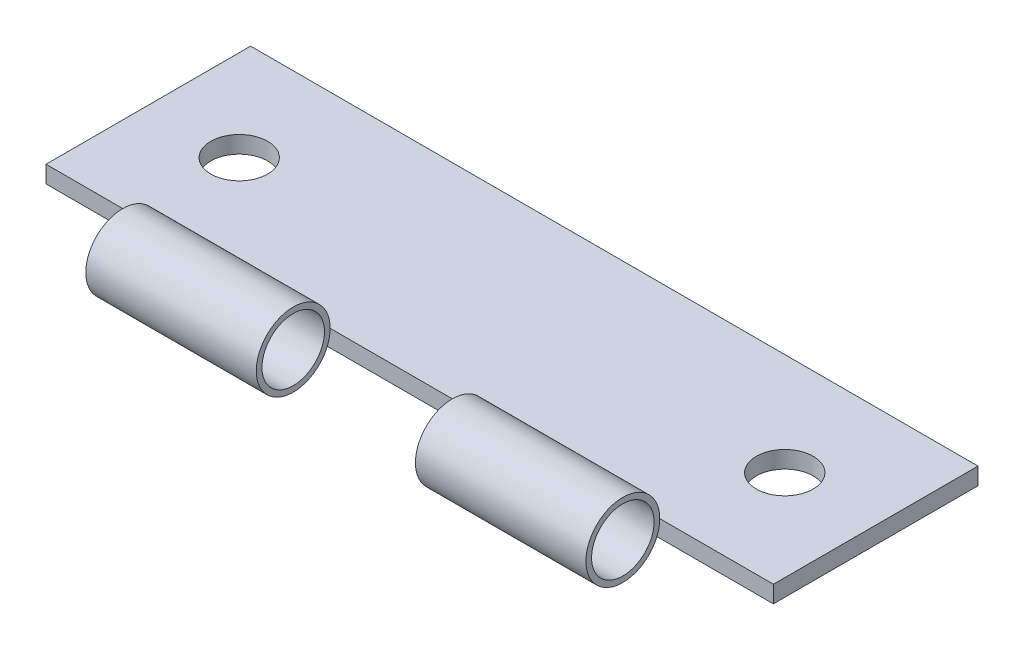
ISO-10303-21;
HEADER;
FILE_DESCRIPTION(('STEP AP214'),'2;1');
FILE_NAME('part.step','',(''),(''),'','','');
FILE_SCHEMA(('AUTOMOTIVE_DESIGN { 1 0 10303 214 1 1 1 1 }'));
ENDSEC;
DATA;
#1=APPLICATION_CONTEXT('core data for automotive mechanical design processes');
#2=APPLICATION_PROTOCOL_DEFINITION('international standard','automotive_design',2000,#1);
#3=PRODUCT_CONTEXT('',#1,'mechanical');
#4=PRODUCT('Part','Part','',(#3));
#5=PRODUCT_RELATED_PRODUCT_CATEGORY('part','',(#4));
#6=PRODUCT_DEFINITION_FORMATION('','',#4);
#7=PRODUCT_DEFINITION_CONTEXT('part definition',#1,'design');
#8=PRODUCT_DEFINITION('design','',#6,#7);
#9=PRODUCT_DEFINITION_SHAPE('','',#8);
#10=(LENGTH_UNIT() NAMED_UNIT(*) SI_UNIT(.MILLI.,.METRE.));
#11=(NAMED_UNIT(*) PLANE_ANGLE_UNIT() SI_UNIT($,.RADIAN.));
#12=(NAMED_UNIT(*) SI_UNIT($,.STERADIAN.) SOLID_ANGLE_UNIT());
#13=UNCERTAINTY_MEASURE_WITH_UNIT(LENGTH_MEASURE(1.E-05),#10,'distance_accuracy_value','');
#14=(GEOMETRIC_REPRESENTATION_CONTEXT(3) GLOBAL_UNCERTAINTY_ASSIGNED_CONTEXT((#13)) GLOBAL_UNIT_ASSIGNED_CONTEXT((#10,
#11,#12)) REPRESENTATION_CONTEXT('',''));
#15=CARTESIAN_POINT('',(0.,0.,0.));
#16=DIRECTION('',(0.,0.,1.));
#17=DIRECTION('',(1.,0.,0.));
#18=AXIS2_PLACEMENT_3D('',#15,#16,#17);
#19=CARTESIAN_POINT('',(32.,1.5,12.25));
#20=DIRECTION('',(-1.,0.,0.));
#21=DIRECTION('',(0.,0.,1.));
#22=AXIS2_PLACEMENT_3D('',#19,#20,#21);
#23=CYLINDRICAL_SURFACE('',#22,3.25);
#24=CARTESIAN_POINT('',(-22.,1.5,12.25));
#25=DIRECTION('',(1.,0.,0.));
#26=DIRECTION('',(0.,0.,-1.));
#27=AXIS2_PLACEMENT_3D('',#24,#25,#26);
#28=CIRCLE('',#27,3.25);
#29=CARTESIAN_POINT('',(-22.,1.5,9.));
#30=VERTEX_POINT('',#29);
#31=EDGE_CURVE('E45',#30,#30,#28,.T.);
#32=ORIENTED_EDGE('',*,*,#31,.T.);
#33=EDGE_LOOP('',(#32));
#34=FACE_BOUND('',#33,.T.);
#35=CARTESIAN_POINT('',(-7.,1.5,12.25));
#36=DIRECTION('',(1.,0.,0.));
#37=DIRECTION('',(0.,0.,-1.));
#38=AXIS2_PLACEMENT_3D('',#35,#36,#37);
#39=CIRCLE('',#38,3.25);
#40=CARTESIAN_POINT('',(-7.,1.5,9.));
#41=VERTEX_POINT('',#40);
#42=EDGE_CURVE('E11',#41,#41,#39,.T.);
#43=ORIENTED_EDGE('',*,*,#42,.F.);
#44=EDGE_LOOP('',(#43));
#45=FACE_BOUND('',#44,.T.);
#46=ADVANCED_FACE('F39',(#34,#45),#23,.T.);
#47=CARTESIAN_POINT('',(-7.,10.,9.));
#48=DIRECTION('',(1.,0.,0.));
#49=DIRECTION('',(0.,0.,-1.));
#50=AXIS2_PLACEMENT_3D('',#47,#48,#49);
#51=PLANE('',#50);
#52=CARTESIAN_POINT('',(-7.,1.5,12.25));
#53=DIRECTION('',(1.,0.,0.));
#54=DIRECTION('',(0.,0.,-1.));
#55=AXIS2_PLACEMENT_3D('',#52,#53,#54);
#56=CIRCLE('',#55,2.75);
#57=CARTESIAN_POINT('',(-7.,1.5,9.50000000000001));
#58=VERTEX_POINT('',#57);
#59=EDGE_CURVE('E49',#58,#58,#56,.T.);
#60=ORIENTED_EDGE('',*,*,#59,.F.);
#61=EDGE_LOOP('',(#60));
#62=FACE_BOUND('',#61,.T.);
#63=ORIENTED_EDGE('',*,*,#42,.T.);
#64=EDGE_LOOP('',(#63));
#65=FACE_BOUND('',#64,.T.);
#66=ADVANCED_FACE('F69',(#62,#65),#51,.T.);
#67=CARTESIAN_POINT('',(-22.,10.,9.));
#68=DIRECTION('',(1.,0.,0.));
#69=DIRECTION('',(0.,0.,-1.));
#70=AXIS2_PLACEMENT_3D('',#67,#68,#69);
#71=PLANE('',#70);
#72=CARTESIAN_POINT('',(-22.,1.5,12.25));
#73=DIRECTION('',(1.,0.,0.));
#74=DIRECTION('',(0.,0.,-1.));
#75=AXIS2_PLACEMENT_3D('',#72,#73,#74);
#76=CIRCLE('',#75,2.75);
#77=CARTESIAN_POINT('',(-22.,1.5,9.50000000000002));
#78=VERTEX_POINT('',#77);
#79=EDGE_CURVE('E53',#78,#78,#76,.T.);
#80=ORIENTED_EDGE('',*,*,#79,.T.);
#81=EDGE_LOOP('',(#80));
#82=FACE_BOUND('',#81,.T.);
#83=ORIENTED_EDGE('',*,*,#31,.F.);
#84=EDGE_LOOP('',(#83));
#85=FACE_BOUND('',#84,.T.);
#86=ADVANCED_FACE('F59',(#82,#85),#71,.F.);
#87=CARTESIAN_POINT('',(-22.,1.5,12.25));
#88=DIRECTION('',(1.,0.,0.));
#89=DIRECTION('',(0.,0.,-1.));
#90=AXIS2_PLACEMENT_3D('',#87,#88,#89);
#91=CYLINDRICAL_SURFACE('',#90,2.75);
#92=ORIENTED_EDGE('',*,*,#59,.T.);
#93=EDGE_LOOP('',(#92));
#94=FACE_BOUND('',#93,.T.);
#95=ORIENTED_EDGE('',*,*,#79,.F.);
#96=EDGE_LOOP('',(#95));
#97=FACE_BOUND('',#96,.T.);
#98=ADVANCED_FACE('F62',(#94,#97),#91,.F.);
#99=CLOSED_SHELL('',(#46,#66,#86,#98));
#100=MANIFOLD_SOLID_BREP('B2',#99);
#101=CARTESIAN_POINT('',(32.,1.5,12.25));
#102=DIRECTION('',(-1.,0.,0.));
#103=DIRECTION('',(0.,0.,1.));
#104=AXIS2_PLACEMENT_3D('',#101,#102,#103);
#105=CYLINDRICAL_SURFACE('',#104,3.25);
#106=CARTESIAN_POINT('',(7.,1.5,12.25));
#107=DIRECTION('',(1.,0.,0.));
#108=DIRECTION('',(0.,0.,-1.));
#109=AXIS2_PLACEMENT_3D('',#106,#107,#108);
#110=CIRCLE('',#109,3.25);
#111=CARTESIAN_POINT('',(7.,1.5,9.));
#112=VERTEX_POINT('',#111);
#113=EDGE_CURVE('E38',#112,#112,#110,.T.);
#114=ORIENTED_EDGE('',*,*,#113,.T.);
#115=EDGE_LOOP('',(#114));
#116=FACE_BOUND('',#115,.T.);
#117=CARTESIAN_POINT('',(22.,1.5,12.25));
#118=DIRECTION('',(1.,0.,0.));
#119=DIRECTION('',(0.,0.,-1.));
#120=AXIS2_PLACEMENT_3D('',#117,#118,#119);
#121=CIRCLE('',#120,3.25);
#122=CARTESIAN_POINT('',(22.,1.5,9.));
#123=VERTEX_POINT('',#122);
#124=EDGE_CURVE('E116',#123,#123,#121,.T.);
#125=ORIENTED_EDGE('',*,*,#124,.F.);
#126=EDGE_LOOP('',(#125));
#127=FACE_BOUND('',#126,.T.);
#128=ADVANCED_FACE('F109',(#116,#127),#105,.T.);
#129=CARTESIAN_POINT('',(22.,10.,9.));
#130=DIRECTION('',(1.,0.,0.));
#131=DIRECTION('',(0.,0.,-1.));
#132=AXIS2_PLACEMENT_3D('',#129,#130,#131);
#133=PLANE('',#132);
#134=CARTESIAN_POINT('',(22.,1.5,12.25));
#135=DIRECTION('',(1.,0.,0.));
#136=DIRECTION('',(0.,0.,-1.));
#137=AXIS2_PLACEMENT_3D('',#134,#135,#136);
#138=CIRCLE('',#137,2.75);
#139=CARTESIAN_POINT('',(22.,1.5,9.5));
#140=VERTEX_POINT('',#139);
#141=EDGE_CURVE('E122',#140,#140,#138,.T.);
#142=ORIENTED_EDGE('',*,*,#141,.F.);
#143=EDGE_LOOP('',(#142));
#144=FACE_BOUND('',#143,.T.);
#145=ORIENTED_EDGE('',*,*,#124,.T.);
#146=EDGE_LOOP('',(#145));
#147=FACE_BOUND('',#146,.T.);
#148=ADVANCED_FACE('F138',(#144,#147),#133,.T.);
#149=CARTESIAN_POINT('',(7.,10.,9.));
#150=DIRECTION('',(1.,0.,0.));
#151=DIRECTION('',(0.,0.,-1.));
#152=AXIS2_PLACEMENT_3D('',#149,#150,#151);
#153=PLANE('',#152);
#154=CARTESIAN_POINT('',(7.,1.5,12.25));
#155=DIRECTION('',(1.,0.,0.));
#156=DIRECTION('',(0.,0.,-1.));
#157=AXIS2_PLACEMENT_3D('',#154,#155,#156);
#158=CIRCLE('',#157,2.75);
#159=CARTESIAN_POINT('',(7.,1.5,9.50000000000001));
#160=VERTEX_POINT('',#159);
#161=EDGE_CURVE('E112',#160,#160,#158,.T.);
#162=ORIENTED_EDGE('',*,*,#161,.T.);
#163=EDGE_LOOP('',(#162));
#164=FACE_BOUND('',#163,.T.);
#165=ORIENTED_EDGE('',*,*,#113,.F.);
#166=EDGE_LOOP('',(#165));
#167=FACE_BOUND('',#166,.T.);
#168=ADVANCED_FACE('F129',(#164,#167),#153,.F.);
#169=CARTESIAN_POINT('',(-22.,1.5,12.25));
#170=DIRECTION('',(1.,0.,0.));
#171=DIRECTION('',(0.,0.,-1.));
#172=AXIS2_PLACEMENT_3D('',#169,#170,#171);
#173=CYLINDRICAL_SURFACE('',#172,2.75);
#174=ORIENTED_EDGE('',*,*,#141,.T.);
#175=EDGE_LOOP('',(#174));
#176=FACE_BOUND('',#175,.T.);
#177=ORIENTED_EDGE('',*,*,#161,.F.);
#178=EDGE_LOOP('',(#177));
#179=FACE_BOUND('',#178,.T.);
#180=ADVANCED_FACE('F132',(#176,#179),#173,.F.);
#181=CLOSED_SHELL('',(#128,#148,#168,#180));
#182=MANIFOLD_SOLID_BREP('B6',#181);
#183=CARTESIAN_POINT('',(32.,1.5,-9.));
#184=DIRECTION('',(-1.,0.,0.));
#185=DIRECTION('',(0.,0.,1.));
#186=AXIS2_PLACEMENT_3D('',#183,#184,#185);
#187=PLANE('',#186);
#188=DIRECTION('',(0.,0.,-1.));
#189=VECTOR('',#188,1.);
#190=CARTESIAN_POINT('',(32.,0.,-9.));
#191=LINE('',#190,#189);
#192=CARTESIAN_POINT('',(32.,0.,9.));
#193=VERTEX_POINT('',#192);
#194=CARTESIAN_POINT('',(32.,0.,-9.));
#195=VERTEX_POINT('',#194);
#196=EDGE_CURVE('E236',#193,#195,#191,.T.);
#197=ORIENTED_EDGE('',*,*,#196,.T.);
#198=DIRECTION('',(0.,-1.,0.));
#199=VECTOR('',#198,1.);
#200=CARTESIAN_POINT('',(32.,1.5,-9.));
#201=LINE('',#200,#199);
#202=CARTESIAN_POINT('',(32.,1.5,-9.));
#203=VERTEX_POINT('',#202);
#204=EDGE_CURVE('E107',#203,#195,#201,.T.);
#205=ORIENTED_EDGE('',*,*,#204,.F.);
#206=DIRECTION('',(0.,0.,-1.));
#207=VECTOR('',#206,1.);
#208=CARTESIAN_POINT('',(32.,1.5,-9.));
#209=LINE('',#208,#207);
#210=CARTESIAN_POINT('',(32.,1.5,9.));
#211=VERTEX_POINT('',#210);
#212=EDGE_CURVE('E223',#211,#203,#209,.T.);
#213=ORIENTED_EDGE('',*,*,#212,.F.);
#214=DIRECTION('',(0.,-1.,0.));
#215=VECTOR('',#214,1.);
#216=CARTESIAN_POINT('',(32.,1.5,9.));
#217=LINE('',#216,#215);
#218=EDGE_CURVE('E232',#211,#193,#217,.T.);
#219=ORIENTED_EDGE('',*,*,#218,.T.);
#220=EDGE_LOOP('',(#197,#205,#213,#219));
#221=FACE_BOUND('',#220,.T.);
#222=ADVANCED_FACE('F170',(#221),#187,.F.);
#223=CARTESIAN_POINT('',(-32.,1.5,-9.));
#224=DIRECTION('',(0.,0.,1.));
#225=DIRECTION('',(1.,0.,0.));
#226=AXIS2_PLACEMENT_3D('',#223,#224,#225);
#227=PLANE('',#226);
#228=DIRECTION('',(-1.,0.,0.));
#229=VECTOR('',#228,1.);
#230=CARTESIAN_POINT('',(-32.,0.,-9.));
#231=LINE('',#230,#229);
#232=CARTESIAN_POINT('',(-32.,0.,-9.));
#233=VERTEX_POINT('',#232);
#234=EDGE_CURVE('E227',#195,#233,#231,.T.);
#235=ORIENTED_EDGE('',*,*,#234,.T.);
#236=DIRECTION('',(0.,-1.,0.));
#237=VECTOR('',#236,1.);
#238=CARTESIAN_POINT('',(-32.,1.5,-9.));
#239=LINE('',#238,#237);
#240=CARTESIAN_POINT('',(-32.,1.5,-9.));
#241=VERTEX_POINT('',#240);
#242=EDGE_CURVE('E179',#241,#233,#239,.T.);
#243=ORIENTED_EDGE('',*,*,#242,.F.);
#244=DIRECTION('',(-1.,0.,0.));
#245=VECTOR('',#244,1.);
#246=CARTESIAN_POINT('',(-32.,1.5,-9.));
#247=LINE('',#246,#245);
#248=EDGE_CURVE('E218',#203,#241,#247,.T.);
#249=ORIENTED_EDGE('',*,*,#248,.F.);
#250=ORIENTED_EDGE('',*,*,#204,.T.);
#251=EDGE_LOOP('',(#235,#243,#249,#250));
#252=FACE_BOUND('',#251,.T.);
#253=ADVANCED_FACE('F226',(#252),#227,.F.);
#254=CARTESIAN_POINT('',(-32.,1.5,-9.));
#255=DIRECTION('',(1.,0.,0.));
#256=DIRECTION('',(0.,0.,-1.));
#257=AXIS2_PLACEMENT_3D('',#254,#255,#256);
#258=PLANE('',#257);
#259=DIRECTION('',(0.,0.,1.));
#260=VECTOR('',#259,1.);
#261=CARTESIAN_POINT('',(-32.,0.,-9.));
#262=LINE('',#261,#260);
#263=CARTESIAN_POINT('',(-32.,0.,9.));
#264=VERTEX_POINT('',#263);
#265=EDGE_CURVE('E205',#233,#264,#262,.T.);
#266=ORIENTED_EDGE('',*,*,#265,.T.);
#267=DIRECTION('',(0.,-1.,0.));
#268=VECTOR('',#267,1.);
#269=CARTESIAN_POINT('',(-32.,1.5,9.));
#270=LINE('',#269,#268);
#271=CARTESIAN_POINT('',(-32.,1.5,9.));
#272=VERTEX_POINT('',#271);
#273=EDGE_CURVE('E228',#272,#264,#270,.T.);
#274=ORIENTED_EDGE('',*,*,#273,.F.);
#275=DIRECTION('',(0.,0.,1.));
#276=VECTOR('',#275,1.);
#277=CARTESIAN_POINT('',(-32.,1.5,-9.));
#278=LINE('',#277,#276);
#279=EDGE_CURVE('E221',#241,#272,#278,.T.);
#280=ORIENTED_EDGE('',*,*,#279,.F.);
#281=ORIENTED_EDGE('',*,*,#242,.T.);
#282=EDGE_LOOP('',(#266,#274,#280,#281));
#283=FACE_BOUND('',#282,.T.);
#284=ADVANCED_FACE('F230',(#283),#258,.F.);
#285=CARTESIAN_POINT('',(-32.,1.5,9.));
#286=DIRECTION('',(0.,0.,-1.));
#287=DIRECTION('',(-1.,0.,0.));
#288=AXIS2_PLACEMENT_3D('',#285,#286,#287);
#289=PLANE('',#288);
#290=ORIENTED_EDGE('',*,*,#218,.F.);
#291=DIRECTION('',(1.,0.,0.));
#292=VECTOR('',#291,1.);
#293=CARTESIAN_POINT('',(-32.,1.5,9.));
#294=LINE('',#293,#292);
#295=EDGE_CURVE('E188',#272,#211,#294,.T.);
#296=ORIENTED_EDGE('',*,*,#295,.F.);
#297=ORIENTED_EDGE('',*,*,#273,.T.);
#298=DIRECTION('',(1.,0.,0.));
#299=VECTOR('',#298,1.);
#300=CARTESIAN_POINT('',(-32.,0.,9.));
#301=LINE('',#300,#299);
#302=EDGE_CURVE('E211',#264,#193,#301,.T.);
#303=ORIENTED_EDGE('',*,*,#302,.T.);
#304=EDGE_LOOP('',(#290,#296,#297,#303));
#305=FACE_BOUND('',#304,.T.);
#306=ADVANCED_FACE('F263',(#305),#289,.F.);
#307=CARTESIAN_POINT('',(0.,1.5,0.));
#308=DIRECTION('',(0.,1.,0.));
#309=DIRECTION('',(0.,0.,1.));
#310=AXIS2_PLACEMENT_3D('',#307,#308,#309);
#311=PLANE('',#310);
#312=CARTESIAN_POINT('',(-24.,1.5,0.));
#313=DIRECTION('',(0.,1.,0.));
#314=DIRECTION('',(0.,0.,1.));
#315=AXIS2_PLACEMENT_3D('',#312,#313,#314);
#316=CIRCLE('',#315,2.5);
#317=CARTESIAN_POINT('',(-24.,1.5,2.5));
#318=VERTEX_POINT('',#317);
#319=EDGE_CURVE('E245',#318,#318,#316,.T.);
#320=ORIENTED_EDGE('',*,*,#319,.F.);
#321=EDGE_LOOP('',(#320));
#322=FACE_BOUND('',#321,.T.);
#323=CARTESIAN_POINT('',(24.,1.5,0.));
#324=DIRECTION('',(0.,1.,0.));
#325=DIRECTION('',(0.,0.,1.));
#326=AXIS2_PLACEMENT_3D('',#323,#324,#325);
#327=CIRCLE('',#326,2.5);
#328=CARTESIAN_POINT('',(24.,1.5,2.5));
#329=VERTEX_POINT('',#328);
#330=EDGE_CURVE('E250',#329,#329,#327,.T.);
#331=ORIENTED_EDGE('',*,*,#330,.F.);
#332=EDGE_LOOP('',(#331));
#333=FACE_BOUND('',#332,.T.);
#334=ORIENTED_EDGE('',*,*,#212,.T.);
#335=ORIENTED_EDGE('',*,*,#248,.T.);
#336=ORIENTED_EDGE('',*,*,#279,.T.);
#337=ORIENTED_EDGE('',*,*,#295,.T.);
#338=EDGE_LOOP('',(#334,#335,#336,#337));
#339=FACE_BOUND('',#338,.T.);
#340=ADVANCED_FACE('F219',(#322,#333,#339),#311,.T.);
#341=CARTESIAN_POINT('',(0.,0.,0.));
#342=DIRECTION('',(0.,1.,0.));
#343=DIRECTION('',(0.,0.,1.));
#344=AXIS2_PLACEMENT_3D('',#341,#342,#343);
#345=PLANE('',#344);
#346=CARTESIAN_POINT('',(-24.,0.,0.));
#347=DIRECTION('',(0.,1.,0.));
#348=DIRECTION('',(0.,0.,1.));
#349=AXIS2_PLACEMENT_3D('',#346,#347,#348);
#350=CIRCLE('',#349,2.5);
#351=CARTESIAN_POINT('',(-24.,0.,2.5));
#352=VERTEX_POINT('',#351);
#353=EDGE_CURVE('E173',#352,#352,#350,.T.);
#354=ORIENTED_EDGE('',*,*,#353,.T.);
#355=EDGE_LOOP('',(#354));
#356=FACE_BOUND('',#355,.T.);
#357=CARTESIAN_POINT('',(24.,0.,0.));
#358=DIRECTION('',(0.,1.,0.));
#359=DIRECTION('',(0.,0.,1.));
#360=AXIS2_PLACEMENT_3D('',#357,#358,#359);
#361=CIRCLE('',#360,2.5);
#362=CARTESIAN_POINT('',(24.,0.,2.5));
#363=VERTEX_POINT('',#362);
#364=EDGE_CURVE('E243',#363,#363,#361,.T.);
#365=ORIENTED_EDGE('',*,*,#364,.T.);
#366=EDGE_LOOP('',(#365));
#367=FACE_BOUND('',#366,.T.);
#368=ORIENTED_EDGE('',*,*,#196,.F.);
#369=ORIENTED_EDGE('',*,*,#302,.F.);
#370=ORIENTED_EDGE('',*,*,#265,.F.);
#371=ORIENTED_EDGE('',*,*,#234,.F.);
#372=EDGE_LOOP('',(#368,#369,#370,#371));
#373=FACE_BOUND('',#372,.T.);
#374=ADVANCED_FACE('F262',(#356,#367,#373),#345,.F.);
#375=CARTESIAN_POINT('',(24.,-8.5,0.));
#376=DIRECTION('',(0.,1.,0.));
#377=DIRECTION('',(0.,0.,1.));
#378=AXIS2_PLACEMENT_3D('',#375,#376,#377);
#379=CYLINDRICAL_SURFACE('',#378,2.5);
#380=ORIENTED_EDGE('',*,*,#330,.T.);
#381=EDGE_LOOP('',(#380));
#382=FACE_BOUND('',#381,.T.);
#383=ORIENTED_EDGE('',*,*,#364,.F.);
#384=EDGE_LOOP('',(#383));
#385=FACE_BOUND('',#384,.T.);
#386=ADVANCED_FACE('F258',(#382,#385),#379,.F.);
#387=CARTESIAN_POINT('',(-24.,-8.5,0.));
#388=DIRECTION('',(0.,1.,0.));
#389=DIRECTION('',(0.,0.,1.));
#390=AXIS2_PLACEMENT_3D('',#387,#388,#389);
#391=CYLINDRICAL_SURFACE('',#390,2.5);
#392=ORIENTED_EDGE('',*,*,#319,.T.);
#393=EDGE_LOOP('',(#392));
#394=FACE_BOUND('',#393,.T.);
#395=ORIENTED_EDGE('',*,*,#353,.F.);
#396=EDGE_LOOP('',(#395));
#397=FACE_BOUND('',#396,.T.);
#398=ADVANCED_FACE('F298',(#394,#397),#391,.F.);
#399=CLOSED_SHELL('',(#222,#253,#284,#306,#340,#374,#386,#398));
#400=MANIFOLD_SOLID_BREP('B33',#399);
#401=ADVANCED_BREP_SHAPE_REPRESENTATION('',(#18,#100,#182,#400),#14);
#402=SHAPE_DEFINITION_REPRESENTATION(#9,#401);
ENDSEC;
END-ISO-10303-21;
